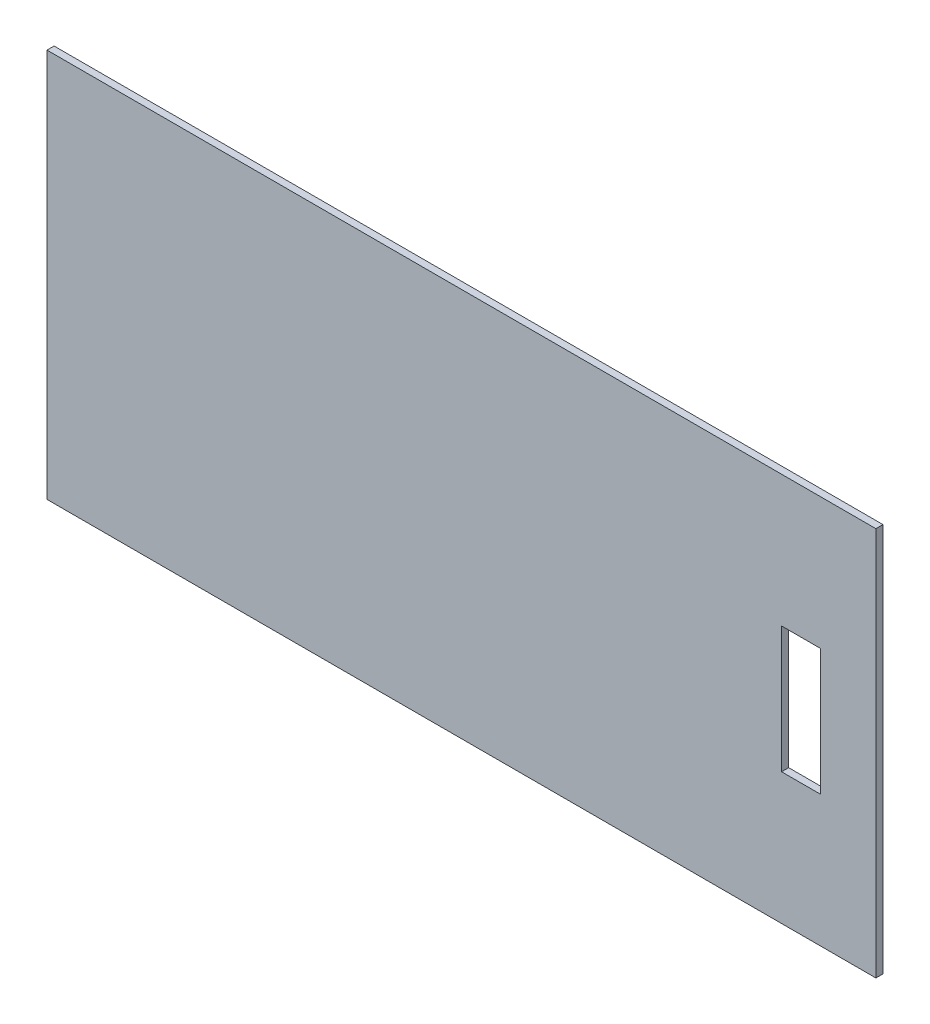
ISO-10303-21;
HEADER;
FILE_DESCRIPTION(('STEP AP214'),'2;1');
FILE_NAME('part.step','',(''),(''),'','','');
FILE_SCHEMA(('AUTOMOTIVE_DESIGN { 1 0 10303 214 1 1 1 1 }'));
ENDSEC;
DATA;
#1=APPLICATION_CONTEXT('core data for automotive mechanical design processes');
#2=APPLICATION_PROTOCOL_DEFINITION('international standard','automotive_design',2000,#1);
#3=PRODUCT_CONTEXT('',#1,'mechanical');
#4=PRODUCT('Part','Part','',(#3));
#5=PRODUCT_RELATED_PRODUCT_CATEGORY('part','',(#4));
#6=PRODUCT_DEFINITION_FORMATION('','',#4);
#7=PRODUCT_DEFINITION_CONTEXT('part definition',#1,'design');
#8=PRODUCT_DEFINITION('design','',#6,#7);
#9=PRODUCT_DEFINITION_SHAPE('','',#8);
#10=(LENGTH_UNIT() NAMED_UNIT(*) SI_UNIT(.MILLI.,.METRE.));
#11=(NAMED_UNIT(*) PLANE_ANGLE_UNIT() SI_UNIT($,.RADIAN.));
#12=(NAMED_UNIT(*) SI_UNIT($,.STERADIAN.) SOLID_ANGLE_UNIT());
#13=UNCERTAINTY_MEASURE_WITH_UNIT(LENGTH_MEASURE(1.E-05),#10,'distance_accuracy_value','');
#14=(GEOMETRIC_REPRESENTATION_CONTEXT(3) GLOBAL_UNCERTAINTY_ASSIGNED_CONTEXT((#13)) GLOBAL_UNIT_ASSIGNED_CONTEXT((#10,
#11,#12)) REPRESENTATION_CONTEXT('',''));
#15=CARTESIAN_POINT('',(0.,0.,0.));
#16=DIRECTION('',(0.,0.,1.));
#17=DIRECTION('',(1.,0.,0.));
#18=AXIS2_PLACEMENT_3D('',#15,#16,#17);
#19=CARTESIAN_POINT('',(-192.386759581882,71.9668989547039,3.5));
#20=DIRECTION('',(1.,0.,0.));
#21=DIRECTION('',(0.,0.,-1.));
#22=AXIS2_PLACEMENT_3D('',#19,#20,#21);
#23=PLANE('',#22);
#24=DIRECTION('',(0.,-1.,0.));
#25=VECTOR('',#24,1.);
#26=CARTESIAN_POINT('',(-192.386759581882,71.9668989547039,0.));
#27=LINE('',#26,#25);
#28=CARTESIAN_POINT('',(-192.386759581882,71.9668989547039,0.));
#29=VERTEX_POINT('',#28);
#30=CARTESIAN_POINT('',(-192.386759581882,-120.033101045296,0.));
#31=VERTEX_POINT('',#30);
#32=EDGE_CURVE('E140',#29,#31,#27,.T.);
#33=ORIENTED_EDGE('',*,*,#32,.T.);
#34=DIRECTION('',(0.,0.,-1.));
#35=VECTOR('',#34,1.);
#36=CARTESIAN_POINT('',(-192.386759581882,-120.033101045296,3.5));
#37=LINE('',#36,#35);
#38=CARTESIAN_POINT('',(-192.386759581882,-120.033101045296,3.5));
#39=VERTEX_POINT('',#38);
#40=EDGE_CURVE('E11',#39,#31,#37,.T.);
#41=ORIENTED_EDGE('',*,*,#40,.F.);
#42=DIRECTION('',(0.,-1.,0.));
#43=VECTOR('',#42,1.);
#44=CARTESIAN_POINT('',(-192.386759581882,71.9668989547039,3.5));
#45=LINE('',#44,#43);
#46=CARTESIAN_POINT('',(-192.386759581882,71.9668989547039,3.5));
#47=VERTEX_POINT('',#46);
#48=EDGE_CURVE('E144',#47,#39,#45,.T.);
#49=ORIENTED_EDGE('',*,*,#48,.F.);
#50=DIRECTION('',(0.,0.,-1.));
#51=VECTOR('',#50,1.);
#52=CARTESIAN_POINT('',(-192.386759581882,71.9668989547039,3.5));
#53=LINE('',#52,#51);
#54=EDGE_CURVE('E154',#47,#29,#53,.T.);
#55=ORIENTED_EDGE('',*,*,#54,.T.);
#56=EDGE_LOOP('',(#33,#41,#49,#55));
#57=FACE_BOUND('',#56,.T.);
#58=ADVANCED_FACE('F43',(#57),#23,.F.);
#59=CARTESIAN_POINT('',(-192.386759581882,-120.033101045296,3.5));
#60=DIRECTION('',(0.,1.,0.));
#61=DIRECTION('',(0.,0.,1.));
#62=AXIS2_PLACEMENT_3D('',#59,#60,#61);
#63=PLANE('',#62);
#64=DIRECTION('',(1.,0.,0.));
#65=VECTOR('',#64,1.);
#66=CARTESIAN_POINT('',(-192.386759581882,-120.033101045296,0.));
#67=LINE('',#66,#65);
#68=CARTESIAN_POINT('',(216.613240418118,-120.033101045296,0.));
#69=VERTEX_POINT('',#68);
#70=EDGE_CURVE('E157',#31,#69,#67,.T.);
#71=ORIENTED_EDGE('',*,*,#70,.T.);
#72=DIRECTION('',(0.,0.,-1.));
#73=VECTOR('',#72,1.);
#74=CARTESIAN_POINT('',(216.613240418118,-120.033101045296,3.5));
#75=LINE('',#74,#73);
#76=CARTESIAN_POINT('',(216.613240418118,-120.033101045296,3.5));
#77=VERTEX_POINT('',#76);
#78=EDGE_CURVE('E50',#77,#69,#75,.T.);
#79=ORIENTED_EDGE('',*,*,#78,.F.);
#80=DIRECTION('',(1.,0.,0.));
#81=VECTOR('',#80,1.);
#82=CARTESIAN_POINT('',(-192.386759581882,-120.033101045296,3.5));
#83=LINE('',#82,#81);
#84=EDGE_CURVE('E147',#39,#77,#83,.T.);
#85=ORIENTED_EDGE('',*,*,#84,.F.);
#86=ORIENTED_EDGE('',*,*,#40,.T.);
#87=EDGE_LOOP('',(#71,#79,#85,#86));
#88=FACE_BOUND('',#87,.T.);
#89=ADVANCED_FACE('F185',(#88),#63,.F.);
#90=CARTESIAN_POINT('',(216.613240418118,71.9668989547039,3.5));
#91=DIRECTION('',(-1.,0.,0.));
#92=DIRECTION('',(0.,-1.,0.));
#93=AXIS2_PLACEMENT_3D('',#90,#91,#92);
#94=PLANE('',#93);
#95=DIRECTION('',(0.,1.,0.));
#96=VECTOR('',#95,1.);
#97=CARTESIAN_POINT('',(216.613240418118,71.9668989547039,0.));
#98=LINE('',#97,#96);
#99=CARTESIAN_POINT('',(216.613240418118,71.9668989547039,0.));
#100=VERTEX_POINT('',#99);
#101=EDGE_CURVE('E159',#69,#100,#98,.T.);
#102=ORIENTED_EDGE('',*,*,#101,.T.);
#103=DIRECTION('',(0.,0.,-1.));
#104=VECTOR('',#103,1.);
#105=CARTESIAN_POINT('',(216.613240418118,71.9668989547039,3.5));
#106=LINE('',#105,#104);
#107=CARTESIAN_POINT('',(216.613240418118,71.9668989547039,3.5));
#108=VERTEX_POINT('',#107);
#109=EDGE_CURVE('E164',#108,#100,#106,.T.);
#110=ORIENTED_EDGE('',*,*,#109,.F.);
#111=DIRECTION('',(0.,1.,0.));
#112=VECTOR('',#111,1.);
#113=CARTESIAN_POINT('',(216.613240418118,71.9668989547039,3.5));
#114=LINE('',#113,#112);
#115=EDGE_CURVE('E150',#77,#108,#114,.T.);
#116=ORIENTED_EDGE('',*,*,#115,.F.);
#117=ORIENTED_EDGE('',*,*,#78,.T.);
#118=EDGE_LOOP('',(#102,#110,#116,#117));
#119=FACE_BOUND('',#118,.T.);
#120=ADVANCED_FACE('F171',(#119),#94,.F.);
#121=CARTESIAN_POINT('',(-192.386759581882,71.9668989547039,3.5));
#122=DIRECTION('',(0.,-1.,0.));
#123=DIRECTION('',(0.,0.,-1.));
#124=AXIS2_PLACEMENT_3D('',#121,#122,#123);
#125=PLANE('',#124);
#126=DIRECTION('',(-1.,0.,0.));
#127=VECTOR('',#126,1.);
#128=CARTESIAN_POINT('',(-192.386759581882,71.9668989547039,0.));
#129=LINE('',#128,#127);
#130=EDGE_CURVE('E148',#100,#29,#129,.T.);
#131=ORIENTED_EDGE('',*,*,#130,.T.);
#132=ORIENTED_EDGE('',*,*,#54,.F.);
#133=DIRECTION('',(-1.,0.,0.));
#134=VECTOR('',#133,1.);
#135=CARTESIAN_POINT('',(-192.386759581882,71.9668989547039,3.5));
#136=LINE('',#135,#134);
#137=EDGE_CURVE('E152',#108,#47,#136,.T.);
#138=ORIENTED_EDGE('',*,*,#137,.F.);
#139=ORIENTED_EDGE('',*,*,#109,.T.);
#140=EDGE_LOOP('',(#131,#132,#138,#139));
#141=FACE_BOUND('',#140,.T.);
#142=ADVANCED_FACE('F178',(#141),#125,.F.);
#143=CARTESIAN_POINT('',(0.,0.,3.5));
#144=DIRECTION('',(0.,0.,1.));
#145=DIRECTION('',(1.,0.,0.));
#146=AXIS2_PLACEMENT_3D('',#143,#144,#145);
#147=PLANE('',#146);
#148=DIRECTION('',(0.,-1.,0.));
#149=VECTOR('',#148,1.);
#150=CARTESIAN_POINT('',(170.063240418118,7.11689895470383,3.5));
#151=LINE('',#150,#149);
#152=CARTESIAN_POINT('',(170.063240418118,7.11689895470383,3.5));
#153=VERTEX_POINT('',#152);
#154=CARTESIAN_POINT('',(170.063240418118,-55.1831010452962,3.5));
#155=VERTEX_POINT('',#154);
#156=EDGE_CURVE('E57',#153,#155,#151,.T.);
#157=ORIENTED_EDGE('',*,*,#156,.F.);
#158=DIRECTION('',(-1.,0.,0.));
#159=VECTOR('',#158,1.);
#160=CARTESIAN_POINT('',(170.063240418118,7.11689895470383,3.5));
#161=LINE('',#160,#159);
#162=CARTESIAN_POINT('',(189.263240418118,7.11689895470383,3.5));
#163=VERTEX_POINT('',#162);
#164=EDGE_CURVE('E125',#163,#153,#161,.T.);
#165=ORIENTED_EDGE('',*,*,#164,.F.);
#166=DIRECTION('',(0.,1.,0.));
#167=VECTOR('',#166,1.);
#168=CARTESIAN_POINT('',(189.263240418118,7.11689895470383,3.5));
#169=LINE('',#168,#167);
#170=CARTESIAN_POINT('',(189.263240418118,-55.1831010452961,3.5));
#171=VERTEX_POINT('',#170);
#172=EDGE_CURVE('E128',#171,#163,#169,.T.);
#173=ORIENTED_EDGE('',*,*,#172,.F.);
#174=DIRECTION('',(1.,0.,0.));
#175=VECTOR('',#174,1.);
#176=CARTESIAN_POINT('',(170.063240418118,-55.1831010452962,3.5));
#177=LINE('',#176,#175);
#178=EDGE_CURVE('E134',#155,#171,#177,.T.);
#179=ORIENTED_EDGE('',*,*,#178,.F.);
#180=EDGE_LOOP('',(#157,#165,#173,#179));
#181=FACE_BOUND('',#180,.T.);
#182=ORIENTED_EDGE('',*,*,#48,.T.);
#183=ORIENTED_EDGE('',*,*,#84,.T.);
#184=ORIENTED_EDGE('',*,*,#115,.T.);
#185=ORIENTED_EDGE('',*,*,#137,.T.);
#186=EDGE_LOOP('',(#182,#183,#184,#185));
#187=FACE_BOUND('',#186,.T.);
#188=ADVANCED_FACE('F184',(#181,#187),#147,.T.);
#189=CARTESIAN_POINT('',(0.,0.,0.));
#190=DIRECTION('',(0.,0.,1.));
#191=DIRECTION('',(1.,0.,0.));
#192=AXIS2_PLACEMENT_3D('',#189,#190,#191);
#193=PLANE('',#192);
#194=DIRECTION('',(-1.,0.,0.));
#195=VECTOR('',#194,1.);
#196=CARTESIAN_POINT('',(170.063240418118,7.11689895470383,0.));
#197=LINE('',#196,#195);
#198=CARTESIAN_POINT('',(189.263240418118,7.11689895470383,0.));
#199=VERTEX_POINT('',#198);
#200=CARTESIAN_POINT('',(170.063240418118,7.11689895470383,0.));
#201=VERTEX_POINT('',#200);
#202=EDGE_CURVE('E115',#199,#201,#197,.T.);
#203=ORIENTED_EDGE('',*,*,#202,.T.);
#204=DIRECTION('',(0.,-1.,0.));
#205=VECTOR('',#204,1.);
#206=CARTESIAN_POINT('',(170.063240418118,7.11689895470383,0.));
#207=LINE('',#206,#205);
#208=CARTESIAN_POINT('',(170.063240418118,-55.1831010452962,0.));
#209=VERTEX_POINT('',#208);
#210=EDGE_CURVE('E109',#201,#209,#207,.T.);
#211=ORIENTED_EDGE('',*,*,#210,.T.);
#212=DIRECTION('',(1.,0.,0.));
#213=VECTOR('',#212,1.);
#214=CARTESIAN_POINT('',(170.063240418118,-55.1831010452962,0.));
#215=LINE('',#214,#213);
#216=CARTESIAN_POINT('',(189.263240418118,-55.1831010452961,0.));
#217=VERTEX_POINT('',#216);
#218=EDGE_CURVE('E118',#209,#217,#215,.T.);
#219=ORIENTED_EDGE('',*,*,#218,.T.);
#220=DIRECTION('',(0.,1.,0.));
#221=VECTOR('',#220,1.);
#222=CARTESIAN_POINT('',(189.263240418118,7.11689895470383,0.));
#223=LINE('',#222,#221);
#224=EDGE_CURVE('E65',#217,#199,#223,.T.);
#225=ORIENTED_EDGE('',*,*,#224,.T.);
#226=EDGE_LOOP('',(#203,#211,#219,#225));
#227=FACE_BOUND('',#226,.T.);
#228=ORIENTED_EDGE('',*,*,#32,.F.);
#229=ORIENTED_EDGE('',*,*,#130,.F.);
#230=ORIENTED_EDGE('',*,*,#101,.F.);
#231=ORIENTED_EDGE('',*,*,#70,.F.);
#232=EDGE_LOOP('',(#228,#229,#230,#231));
#233=FACE_BOUND('',#232,.T.);
#234=ADVANCED_FACE('F122',(#227,#233),#193,.F.);
#235=CARTESIAN_POINT('',(170.063240418118,7.11689895470383,0.));
#236=DIRECTION('',(-1.,0.,0.));
#237=DIRECTION('',(0.,0.,1.));
#238=AXIS2_PLACEMENT_3D('',#235,#236,#237);
#239=PLANE('',#238);
#240=ORIENTED_EDGE('',*,*,#156,.T.);
#241=DIRECTION('',(0.,0.,1.));
#242=VECTOR('',#241,1.);
#243=CARTESIAN_POINT('',(170.063240418118,-55.1831010452962,0.));
#244=LINE('',#243,#242);
#245=EDGE_CURVE('E105',#209,#155,#244,.T.);
#246=ORIENTED_EDGE('',*,*,#245,.F.);
#247=ORIENTED_EDGE('',*,*,#210,.F.);
#248=DIRECTION('',(0.,0.,1.));
#249=VECTOR('',#248,1.);
#250=CARTESIAN_POINT('',(170.063240418118,7.11689895470383,0.));
#251=LINE('',#250,#249);
#252=EDGE_CURVE('E138',#201,#153,#251,.T.);
#253=ORIENTED_EDGE('',*,*,#252,.T.);
#254=EDGE_LOOP('',(#240,#246,#247,#253));
#255=FACE_BOUND('',#254,.T.);
#256=ADVANCED_FACE('F107',(#255),#239,.F.);
#257=CARTESIAN_POINT('',(170.063240418118,7.11689895470383,0.));
#258=DIRECTION('',(0.,1.,0.));
#259=DIRECTION('',(0.,0.,1.));
#260=AXIS2_PLACEMENT_3D('',#257,#258,#259);
#261=PLANE('',#260);
#262=ORIENTED_EDGE('',*,*,#164,.T.);
#263=ORIENTED_EDGE('',*,*,#252,.F.);
#264=ORIENTED_EDGE('',*,*,#202,.F.);
#265=DIRECTION('',(0.,0.,1.));
#266=VECTOR('',#265,1.);
#267=CARTESIAN_POINT('',(189.263240418118,7.11689895470383,0.));
#268=LINE('',#267,#266);
#269=EDGE_CURVE('E141',#199,#163,#268,.T.);
#270=ORIENTED_EDGE('',*,*,#269,.T.);
#271=EDGE_LOOP('',(#262,#263,#264,#270));
#272=FACE_BOUND('',#271,.T.);
#273=ADVANCED_FACE('F202',(#272),#261,.F.);
#274=CARTESIAN_POINT('',(189.263240418118,7.11689895470383,0.));
#275=DIRECTION('',(1.,0.,0.));
#276=DIRECTION('',(0.,0.,-1.));
#277=AXIS2_PLACEMENT_3D('',#274,#275,#276);
#278=PLANE('',#277);
#279=ORIENTED_EDGE('',*,*,#172,.T.);
#280=ORIENTED_EDGE('',*,*,#269,.F.);
#281=ORIENTED_EDGE('',*,*,#224,.F.);
#282=DIRECTION('',(0.,0.,1.));
#283=VECTOR('',#282,1.);
#284=CARTESIAN_POINT('',(189.263240418118,-55.1831010452961,0.));
#285=LINE('',#284,#283);
#286=EDGE_CURVE('E114',#217,#171,#285,.T.);
#287=ORIENTED_EDGE('',*,*,#286,.T.);
#288=EDGE_LOOP('',(#279,#280,#281,#287));
#289=FACE_BOUND('',#288,.T.);
#290=ADVANCED_FACE('F205',(#289),#278,.F.);
#291=CARTESIAN_POINT('',(170.063240418118,-55.1831010452962,0.));
#292=DIRECTION('',(0.,-1.,0.));
#293=DIRECTION('',(1.,0.,0.));
#294=AXIS2_PLACEMENT_3D('',#291,#292,#293);
#295=PLANE('',#294);
#296=ORIENTED_EDGE('',*,*,#178,.T.);
#297=ORIENTED_EDGE('',*,*,#286,.F.);
#298=ORIENTED_EDGE('',*,*,#218,.F.);
#299=ORIENTED_EDGE('',*,*,#245,.T.);
#300=EDGE_LOOP('',(#296,#297,#298,#299));
#301=FACE_BOUND('',#300,.T.);
#302=ADVANCED_FACE('F119',(#301),#295,.F.);
#303=CLOSED_SHELL('',(#58,#89,#120,#142,#188,#234,#256,#273,#290,#302));
#304=MANIFOLD_SOLID_BREP('B2',#303);
#305=ADVANCED_BREP_SHAPE_REPRESENTATION('',(#18,#304),#14);
#306=SHAPE_DEFINITION_REPRESENTATION(#9,#305);
ENDSEC;
END-ISO-10303-21;
